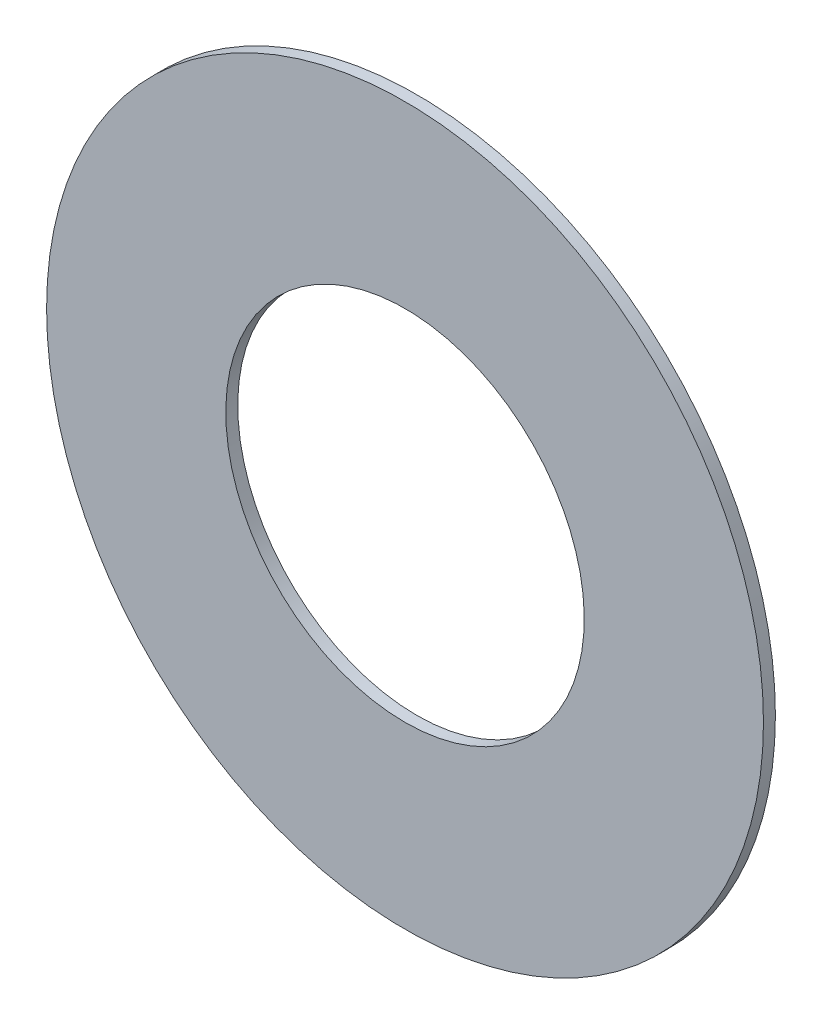
ISO-10303-21;
HEADER;
FILE_DESCRIPTION(('STEP AP214'),'2;1');
FILE_NAME('part.step','',(''),(''),'','','');
FILE_SCHEMA(('AUTOMOTIVE_DESIGN { 1 0 10303 214 1 1 1 1 }'));
ENDSEC;
DATA;
#1=APPLICATION_CONTEXT('core data for automotive mechanical design processes');
#2=APPLICATION_PROTOCOL_DEFINITION('international standard','automotive_design',2000,#1);
#3=PRODUCT_CONTEXT('',#1,'mechanical');
#4=PRODUCT('Part','Part','',(#3));
#5=PRODUCT_RELATED_PRODUCT_CATEGORY('part','',(#4));
#6=PRODUCT_DEFINITION_FORMATION('','',#4);
#7=PRODUCT_DEFINITION_CONTEXT('part definition',#1,'design');
#8=PRODUCT_DEFINITION('design','',#6,#7);
#9=PRODUCT_DEFINITION_SHAPE('','',#8);
#10=(LENGTH_UNIT() NAMED_UNIT(*) SI_UNIT(.MILLI.,.METRE.));
#11=(NAMED_UNIT(*) PLANE_ANGLE_UNIT() SI_UNIT($,.RADIAN.));
#12=(NAMED_UNIT(*) SI_UNIT($,.STERADIAN.) SOLID_ANGLE_UNIT());
#13=UNCERTAINTY_MEASURE_WITH_UNIT(LENGTH_MEASURE(1.E-05),#10,'distance_accuracy_value','');
#14=(GEOMETRIC_REPRESENTATION_CONTEXT(3) GLOBAL_UNCERTAINTY_ASSIGNED_CONTEXT((#13)) GLOBAL_UNIT_ASSIGNED_CONTEXT((#10,
#11,#12)) REPRESENTATION_CONTEXT('',''));
#15=CARTESIAN_POINT('',(0.,0.,0.));
#16=DIRECTION('',(0.,0.,1.));
#17=DIRECTION('',(1.,0.,0.));
#18=AXIS2_PLACEMENT_3D('',#15,#16,#17);
#19=CARTESIAN_POINT('',(139.452,-114.284,-0.045));
#20=DIRECTION('',(0.,0.,-1.));
#21=DIRECTION('',(0.,-1.,0.));
#22=AXIS2_PLACEMENT_3D('',#19,#20,#21);
#23=CYLINDRICAL_SURFACE('',#22,0.525);
#24=CARTESIAN_POINT('',(139.452,-114.284,1.67));
#25=DIRECTION('',(0.,0.,-1.));
#26=DIRECTION('',(0.,-1.,0.));
#27=AXIS2_PLACEMENT_3D('',#24,#25,#26);
#28=CIRCLE('',#27,0.525);
#29=CARTESIAN_POINT('',(139.452,-114.809,1.67));
#30=VERTEX_POINT('',#29);
#31=EDGE_CURVE('E25',#30,#30,#28,.T.);
#32=ORIENTED_EDGE('',*,*,#31,.T.);
#33=DIRECTION('',(0.,0.,1.));
#34=VECTOR('',#33,1.);
#35=CARTESIAN_POINT('',(139.452,-114.809,-0.045));
#36=LINE('',#35,#34);
#37=CARTESIAN_POINT('',(139.452,-114.809,1.705));
#38=VERTEX_POINT('',#37);
#39=EDGE_CURVE('E11',#30,#38,#36,.T.);
#40=ORIENTED_EDGE('',*,*,#39,.T.);
#41=CARTESIAN_POINT('',(139.452,-114.284,1.705));
#42=DIRECTION('',(0.,0.,-1.));
#43=DIRECTION('',(0.,-1.,0.));
#44=AXIS2_PLACEMENT_3D('',#41,#42,#43);
#45=CIRCLE('',#44,0.525);
#46=EDGE_CURVE('E69',#38,#38,#45,.T.);
#47=ORIENTED_EDGE('',*,*,#46,.F.);
#48=ORIENTED_EDGE('',*,*,#39,.F.);
#49=EDGE_LOOP('',(#32,#40,#47,#48));
#50=FACE_BOUND('',#49,.T.);
#51=ADVANCED_FACE('F17',(#50),#23,.F.);
#52=CARTESIAN_POINT('',(139.452,-114.284,1.67));
#53=DIRECTION('',(0.,0.,1.));
#54=DIRECTION('',(1.,0.,0.));
#55=AXIS2_PLACEMENT_3D('',#52,#53,#54);
#56=PLANE('',#55);
#57=ORIENTED_EDGE('',*,*,#31,.F.);
#58=EDGE_LOOP('',(#57));
#59=FACE_BOUND('',#58,.T.);
#60=CARTESIAN_POINT('',(139.452,-114.284,1.67));
#61=DIRECTION('',(0.,0.,1.));
#62=DIRECTION('',(1.,0.,0.));
#63=AXIS2_PLACEMENT_3D('',#60,#61,#62);
#64=CIRCLE('',#63,1.05);
#65=CARTESIAN_POINT('',(140.502,-114.284,1.67));
#66=VERTEX_POINT('',#65);
#67=EDGE_CURVE('E56',#66,#66,#64,.T.);
#68=ORIENTED_EDGE('',*,*,#67,.F.);
#69=EDGE_LOOP('',(#68));
#70=FACE_BOUND('',#69,.T.);
#71=ADVANCED_FACE('F92',(#59,#70),#56,.F.);
#72=CARTESIAN_POINT('',(139.452,-114.284,1.705));
#73=DIRECTION('',(0.,0.,1.));
#74=DIRECTION('',(1.,0.,0.));
#75=AXIS2_PLACEMENT_3D('',#72,#73,#74);
#76=PLANE('',#75);
#77=ORIENTED_EDGE('',*,*,#46,.T.);
#78=EDGE_LOOP('',(#77));
#79=FACE_BOUND('',#78,.T.);
#80=CARTESIAN_POINT('',(139.452,-114.284,1.705));
#81=DIRECTION('',(0.,0.,1.));
#82=DIRECTION('',(1.,0.,0.));
#83=AXIS2_PLACEMENT_3D('',#80,#81,#82);
#84=CIRCLE('',#83,1.05);
#85=CARTESIAN_POINT('',(140.502,-114.284,1.705));
#86=VERTEX_POINT('',#85);
#87=EDGE_CURVE('E54',#86,#86,#84,.T.);
#88=ORIENTED_EDGE('',*,*,#87,.T.);
#89=EDGE_LOOP('',(#88));
#90=FACE_BOUND('',#89,.T.);
#91=ADVANCED_FACE('F60',(#79,#90),#76,.T.);
#92=CARTESIAN_POINT('',(139.452,-114.284,1.67));
#93=DIRECTION('',(0.,0.,1.));
#94=DIRECTION('',(1.,0.,0.));
#95=AXIS2_PLACEMENT_3D('',#92,#93,#94);
#96=CYLINDRICAL_SURFACE('',#95,1.05);
#97=ORIENTED_EDGE('',*,*,#87,.F.);
#98=DIRECTION('',(0.,0.,1.));
#99=VECTOR('',#98,1.);
#100=CARTESIAN_POINT('',(140.502,-114.284,1.67));
#101=LINE('',#100,#99);
#102=EDGE_CURVE('E51',#66,#86,#101,.T.);
#103=ORIENTED_EDGE('',*,*,#102,.F.);
#104=ORIENTED_EDGE('',*,*,#67,.T.);
#105=ORIENTED_EDGE('',*,*,#102,.T.);
#106=EDGE_LOOP('',(#97,#103,#104,#105));
#107=FACE_BOUND('',#106,.T.);
#108=ADVANCED_FACE('F53',(#107),#96,.T.);
#109=CLOSED_SHELL('',(#51,#71,#91,#108));
#110=MANIFOLD_SOLID_BREP('B1',#109);
#111=ADVANCED_BREP_SHAPE_REPRESENTATION('',(#18,#110),#14);
#112=SHAPE_DEFINITION_REPRESENTATION(#9,#111);
ENDSEC;
END-ISO-10303-21;
